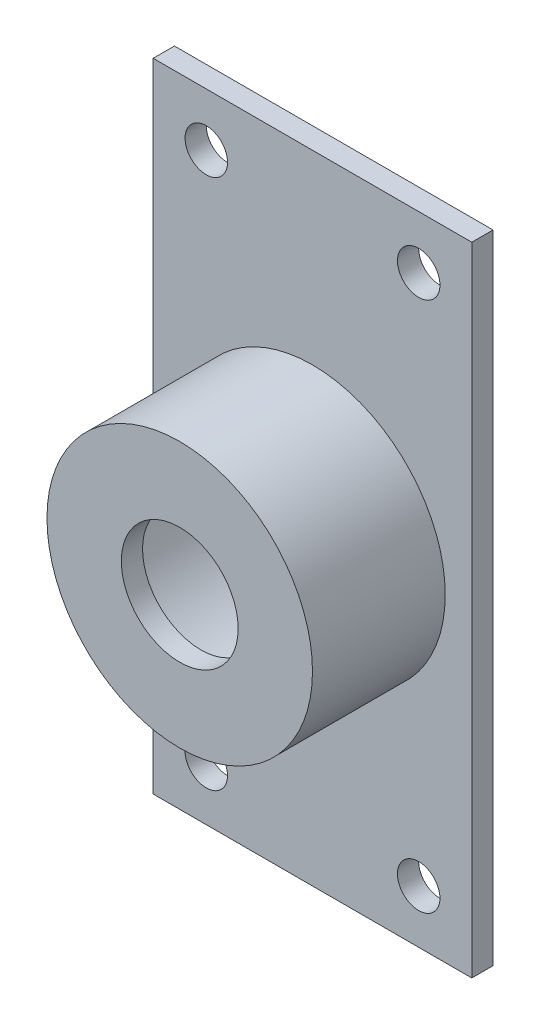
ISO-10303-21;
HEADER;
FILE_DESCRIPTION(('STEP AP214'),'2;1');
FILE_NAME('part.step','',(''),(''),'','','');
FILE_SCHEMA(('AUTOMOTIVE_DESIGN { 1 0 10303 214 1 1 1 1 }'));
ENDSEC;
DATA;
#1=APPLICATION_CONTEXT('core data for automotive mechanical design processes');
#2=APPLICATION_PROTOCOL_DEFINITION('international standard','automotive_design',2000,#1);
#3=PRODUCT_CONTEXT('',#1,'mechanical');
#4=PRODUCT('Part','Part','',(#3));
#5=PRODUCT_RELATED_PRODUCT_CATEGORY('part','',(#4));
#6=PRODUCT_DEFINITION_FORMATION('','',#4);
#7=PRODUCT_DEFINITION_CONTEXT('part definition',#1,'design');
#8=PRODUCT_DEFINITION('design','',#6,#7);
#9=PRODUCT_DEFINITION_SHAPE('','',#8);
#10=(LENGTH_UNIT() NAMED_UNIT(*) SI_UNIT(.MILLI.,.METRE.));
#11=(NAMED_UNIT(*) PLANE_ANGLE_UNIT() SI_UNIT($,.RADIAN.));
#12=(NAMED_UNIT(*) SI_UNIT($,.STERADIAN.) SOLID_ANGLE_UNIT());
#13=UNCERTAINTY_MEASURE_WITH_UNIT(LENGTH_MEASURE(1.E-05),#10,'distance_accuracy_value','');
#14=(GEOMETRIC_REPRESENTATION_CONTEXT(3) GLOBAL_UNCERTAINTY_ASSIGNED_CONTEXT((#13)) GLOBAL_UNIT_ASSIGNED_CONTEXT((#10,
#11,#12)) REPRESENTATION_CONTEXT('',''));
#15=CARTESIAN_POINT('',(0.,0.,0.));
#16=DIRECTION('',(0.,0.,1.));
#17=DIRECTION('',(1.,0.,0.));
#18=AXIS2_PLACEMENT_3D('',#15,#16,#17);
#19=CARTESIAN_POINT('',(30.,-60.,4.));
#20=DIRECTION('',(-1.,0.,0.));
#21=DIRECTION('',(0.,0.,1.));
#22=AXIS2_PLACEMENT_3D('',#19,#20,#21);
#23=PLANE('',#22);
#24=DIRECTION('',(0.,1.,0.));
#25=VECTOR('',#24,1.);
#26=CARTESIAN_POINT('',(30.,-60.,0.));
#27=LINE('',#26,#25);
#28=CARTESIAN_POINT('',(30.,-60.,0.));
#29=VERTEX_POINT('',#28);
#30=CARTESIAN_POINT('',(30.,60.,0.));
#31=VERTEX_POINT('',#30);
#32=EDGE_CURVE('E102',#29,#31,#27,.T.);
#33=ORIENTED_EDGE('',*,*,#32,.T.);
#34=DIRECTION('',(0.,0.,-1.));
#35=VECTOR('',#34,1.);
#36=CARTESIAN_POINT('',(30.,60.,4.));
#37=LINE('',#36,#35);
#38=CARTESIAN_POINT('',(30.,60.,4.));
#39=VERTEX_POINT('',#38);
#40=EDGE_CURVE('E44',#39,#31,#37,.T.);
#41=ORIENTED_EDGE('',*,*,#40,.F.);
#42=DIRECTION('',(0.,1.,0.));
#43=VECTOR('',#42,1.);
#44=CARTESIAN_POINT('',(30.,-60.,4.));
#45=LINE('',#44,#43);
#46=CARTESIAN_POINT('',(30.,-60.,4.));
#47=VERTEX_POINT('',#46);
#48=EDGE_CURVE('E88',#47,#39,#45,.T.);
#49=ORIENTED_EDGE('',*,*,#48,.F.);
#50=DIRECTION('',(0.,0.,-1.));
#51=VECTOR('',#50,1.);
#52=CARTESIAN_POINT('',(30.,-60.,4.));
#53=LINE('',#52,#51);
#54=EDGE_CURVE('E98',#47,#29,#53,.T.);
#55=ORIENTED_EDGE('',*,*,#54,.T.);
#56=EDGE_LOOP('',(#33,#41,#49,#55));
#57=FACE_BOUND('',#56,.T.);
#58=ADVANCED_FACE('F35',(#57),#23,.F.);
#59=CARTESIAN_POINT('',(-30.,60.,4.));
#60=DIRECTION('',(0.,-1.,0.));
#61=DIRECTION('',(0.,0.,-1.));
#62=AXIS2_PLACEMENT_3D('',#59,#60,#61);
#63=PLANE('',#62);
#64=DIRECTION('',(-1.,0.,0.));
#65=VECTOR('',#64,1.);
#66=CARTESIAN_POINT('',(-30.,60.,0.));
#67=LINE('',#66,#65);
#68=CARTESIAN_POINT('',(-30.,60.,0.));
#69=VERTEX_POINT('',#68);
#70=EDGE_CURVE('E93',#31,#69,#67,.T.);
#71=ORIENTED_EDGE('',*,*,#70,.T.);
#72=DIRECTION('',(0.,0.,-1.));
#73=VECTOR('',#72,1.);
#74=CARTESIAN_POINT('',(-30.,60.,4.));
#75=LINE('',#74,#73);
#76=CARTESIAN_POINT('',(-30.,60.,4.));
#77=VERTEX_POINT('',#76);
#78=EDGE_CURVE('E91',#77,#69,#75,.T.);
#79=ORIENTED_EDGE('',*,*,#78,.F.);
#80=DIRECTION('',(-1.,0.,0.));
#81=VECTOR('',#80,1.);
#82=CARTESIAN_POINT('',(-30.,60.,4.));
#83=LINE('',#82,#81);
#84=EDGE_CURVE('E83',#39,#77,#83,.T.);
#85=ORIENTED_EDGE('',*,*,#84,.F.);
#86=ORIENTED_EDGE('',*,*,#40,.T.);
#87=EDGE_LOOP('',(#71,#79,#85,#86));
#88=FACE_BOUND('',#87,.T.);
#89=ADVANCED_FACE('F92',(#88),#63,.F.);
#90=CARTESIAN_POINT('',(-30.,-60.,4.));
#91=DIRECTION('',(1.,0.,0.));
#92=DIRECTION('',(0.,0.,-1.));
#93=AXIS2_PLACEMENT_3D('',#90,#91,#92);
#94=PLANE('',#93);
#95=DIRECTION('',(0.,-1.,0.));
#96=VECTOR('',#95,1.);
#97=CARTESIAN_POINT('',(-30.,-60.,0.));
#98=LINE('',#97,#96);
#99=CARTESIAN_POINT('',(-30.,-60.,0.));
#100=VERTEX_POINT('',#99);
#101=EDGE_CURVE('E69',#69,#100,#98,.T.);
#102=ORIENTED_EDGE('',*,*,#101,.T.);
#103=DIRECTION('',(0.,0.,-1.));
#104=VECTOR('',#103,1.);
#105=CARTESIAN_POINT('',(-30.,-60.,4.));
#106=LINE('',#105,#104);
#107=CARTESIAN_POINT('',(-30.,-60.,4.));
#108=VERTEX_POINT('',#107);
#109=EDGE_CURVE('E94',#108,#100,#106,.T.);
#110=ORIENTED_EDGE('',*,*,#109,.F.);
#111=DIRECTION('',(0.,-1.,0.));
#112=VECTOR('',#111,1.);
#113=CARTESIAN_POINT('',(-30.,-60.,4.));
#114=LINE('',#113,#112);
#115=EDGE_CURVE('E86',#77,#108,#114,.T.);
#116=ORIENTED_EDGE('',*,*,#115,.F.);
#117=ORIENTED_EDGE('',*,*,#78,.T.);
#118=EDGE_LOOP('',(#102,#110,#116,#117));
#119=FACE_BOUND('',#118,.T.);
#120=ADVANCED_FACE('F96',(#119),#94,.F.);
#121=CARTESIAN_POINT('',(-30.,-60.,4.));
#122=DIRECTION('',(0.,1.,0.));
#123=DIRECTION('',(0.,0.,1.));
#124=AXIS2_PLACEMENT_3D('',#121,#122,#123);
#125=PLANE('',#124);
#126=DIRECTION('',(1.,0.,0.));
#127=VECTOR('',#126,1.);
#128=CARTESIAN_POINT('',(-30.,-60.,0.));
#129=LINE('',#128,#127);
#130=EDGE_CURVE('E75',#100,#29,#129,.T.);
#131=ORIENTED_EDGE('',*,*,#130,.T.);
#132=ORIENTED_EDGE('',*,*,#54,.F.);
#133=DIRECTION('',(1.,0.,0.));
#134=VECTOR('',#133,1.);
#135=CARTESIAN_POINT('',(-30.,-60.,4.));
#136=LINE('',#135,#134);
#137=EDGE_CURVE('E52',#108,#47,#136,.T.);
#138=ORIENTED_EDGE('',*,*,#137,.F.);
#139=ORIENTED_EDGE('',*,*,#109,.T.);
#140=EDGE_LOOP('',(#131,#132,#138,#139));
#141=FACE_BOUND('',#140,.T.);
#142=ADVANCED_FACE('F126',(#141),#125,.F.);
#143=CARTESIAN_POINT('',(0.,0.,4.));
#144=DIRECTION('',(0.,0.,-1.));
#145=DIRECTION('',(-1.,0.,0.));
#146=AXIS2_PLACEMENT_3D('',#143,#144,#145);
#147=PLANE('',#146);
#148=CARTESIAN_POINT('',(0.,0.,4.));
#149=DIRECTION('',(0.,0.,-1.));
#150=DIRECTION('',(-1.,0.,0.));
#151=AXIS2_PLACEMENT_3D('',#148,#149,#150);
#152=CIRCLE('',#151,25.);
#153=CARTESIAN_POINT('',(-25.,0.,4.));
#154=VERTEX_POINT('',#153);
#155=EDGE_CURVE('E11',#154,#154,#152,.F.);
#156=ORIENTED_EDGE('',*,*,#155,.F.);
#157=EDGE_LOOP('',(#156));
#158=FACE_BOUND('',#157,.T.);
#159=CARTESIAN_POINT('',(-19.999999999999,-50.,4.));
#160=DIRECTION('',(0.,0.,1.));
#161=DIRECTION('',(1.,0.,0.));
#162=AXIS2_PLACEMENT_3D('',#159,#160,#161);
#163=CIRCLE('',#162,4.);
#164=CARTESIAN_POINT('',(-15.999999999999,-50.,4.));
#165=VERTEX_POINT('',#164);
#166=EDGE_CURVE('E233',#165,#165,#163,.T.);
#167=ORIENTED_EDGE('',*,*,#166,.F.);
#168=EDGE_LOOP('',(#167));
#169=FACE_BOUND('',#168,.T.);
#170=CARTESIAN_POINT('',(20.000000000001,-50.,4.));
#171=DIRECTION('',(0.,0.,1.));
#172=DIRECTION('',(1.,0.,0.));
#173=AXIS2_PLACEMENT_3D('',#170,#171,#172);
#174=CIRCLE('',#173,4.);
#175=CARTESIAN_POINT('',(24.000000000001,-50.,4.));
#176=VERTEX_POINT('',#175);
#177=EDGE_CURVE('E237',#176,#176,#174,.T.);
#178=ORIENTED_EDGE('',*,*,#177,.F.);
#179=EDGE_LOOP('',(#178));
#180=FACE_BOUND('',#179,.T.);
#181=CARTESIAN_POINT('',(20.,50.,4.));
#182=DIRECTION('',(0.,0.,1.));
#183=DIRECTION('',(1.,0.,0.));
#184=AXIS2_PLACEMENT_3D('',#181,#182,#183);
#185=CIRCLE('',#184,4.);
#186=CARTESIAN_POINT('',(24.,50.,4.));
#187=VERTEX_POINT('',#186);
#188=EDGE_CURVE('E252',#187,#187,#185,.T.);
#189=ORIENTED_EDGE('',*,*,#188,.F.);
#190=EDGE_LOOP('',(#189));
#191=FACE_BOUND('',#190,.T.);
#192=CARTESIAN_POINT('',(-20.,50.,4.));
#193=DIRECTION('',(0.,0.,1.));
#194=DIRECTION('',(1.,0.,0.));
#195=AXIS2_PLACEMENT_3D('',#192,#193,#194);
#196=CIRCLE('',#195,4.);
#197=CARTESIAN_POINT('',(-16.,50.,4.));
#198=VERTEX_POINT('',#197);
#199=EDGE_CURVE('E246',#198,#198,#196,.T.);
#200=ORIENTED_EDGE('',*,*,#199,.F.);
#201=EDGE_LOOP('',(#200));
#202=FACE_BOUND('',#201,.T.);
#203=ORIENTED_EDGE('',*,*,#48,.T.);
#204=ORIENTED_EDGE('',*,*,#84,.T.);
#205=ORIENTED_EDGE('',*,*,#115,.T.);
#206=ORIENTED_EDGE('',*,*,#137,.T.);
#207=EDGE_LOOP('',(#203,#204,#205,#206));
#208=FACE_BOUND('',#207,.T.);
#209=ADVANCED_FACE('F84',(#158,#169,#180,#191,#202,#208),#147,.F.);
#210=CARTESIAN_POINT('',(0.,0.,0.));
#211=DIRECTION('',(0.,0.,-1.));
#212=DIRECTION('',(-1.,0.,0.));
#213=AXIS2_PLACEMENT_3D('',#210,#211,#212);
#214=PLANE('',#213);
#215=CARTESIAN_POINT('',(0.,0.,0.));
#216=DIRECTION('',(0.,0.,-1.));
#217=DIRECTION('',(-1.,0.,0.));
#218=AXIS2_PLACEMENT_3D('',#215,#216,#217);
#219=CIRCLE('',#218,21.6);
#220=CARTESIAN_POINT('',(-21.6,0.,0.));
#221=VERTEX_POINT('',#220);
#222=EDGE_CURVE('E274',#221,#221,#219,.T.);
#223=ORIENTED_EDGE('',*,*,#222,.F.);
#224=EDGE_LOOP('',(#223));
#225=FACE_BOUND('',#224,.T.);
#226=CARTESIAN_POINT('',(-19.999999999999,-50.,0.));
#227=DIRECTION('',(0.,0.,1.));
#228=DIRECTION('',(1.,0.,0.));
#229=AXIS2_PLACEMENT_3D('',#226,#227,#228);
#230=CIRCLE('',#229,4.);
#231=CARTESIAN_POINT('',(-15.999999999999,-50.,0.));
#232=VERTEX_POINT('',#231);
#233=EDGE_CURVE('E230',#232,#232,#230,.T.);
#234=ORIENTED_EDGE('',*,*,#233,.T.);
#235=EDGE_LOOP('',(#234));
#236=FACE_BOUND('',#235,.T.);
#237=CARTESIAN_POINT('',(20.000000000001,-50.,0.));
#238=DIRECTION('',(0.,0.,1.));
#239=DIRECTION('',(1.,0.,0.));
#240=AXIS2_PLACEMENT_3D('',#237,#238,#239);
#241=CIRCLE('',#240,4.);
#242=CARTESIAN_POINT('',(24.000000000001,-50.,0.));
#243=VERTEX_POINT('',#242);
#244=EDGE_CURVE('E257',#243,#243,#241,.T.);
#245=ORIENTED_EDGE('',*,*,#244,.T.);
#246=EDGE_LOOP('',(#245));
#247=FACE_BOUND('',#246,.T.);
#248=CARTESIAN_POINT('',(20.,50.,0.));
#249=DIRECTION('',(0.,0.,1.));
#250=DIRECTION('',(1.,0.,0.));
#251=AXIS2_PLACEMENT_3D('',#248,#249,#250);
#252=CIRCLE('',#251,4.);
#253=CARTESIAN_POINT('',(24.,50.,0.));
#254=VERTEX_POINT('',#253);
#255=EDGE_CURVE('E248',#254,#254,#252,.T.);
#256=ORIENTED_EDGE('',*,*,#255,.T.);
#257=EDGE_LOOP('',(#256));
#258=FACE_BOUND('',#257,.T.);
#259=CARTESIAN_POINT('',(-20.,50.,0.));
#260=DIRECTION('',(0.,0.,1.));
#261=DIRECTION('',(1.,0.,0.));
#262=AXIS2_PLACEMENT_3D('',#259,#260,#261);
#263=CIRCLE('',#262,4.);
#264=CARTESIAN_POINT('',(-16.,50.,0.));
#265=VERTEX_POINT('',#264);
#266=EDGE_CURVE('E105',#265,#265,#263,.T.);
#267=ORIENTED_EDGE('',*,*,#266,.T.);
#268=EDGE_LOOP('',(#267));
#269=FACE_BOUND('',#268,.T.);
#270=ORIENTED_EDGE('',*,*,#32,.F.);
#271=ORIENTED_EDGE('',*,*,#130,.F.);
#272=ORIENTED_EDGE('',*,*,#101,.F.);
#273=ORIENTED_EDGE('',*,*,#70,.F.);
#274=EDGE_LOOP('',(#270,#271,#272,#273));
#275=FACE_BOUND('',#274,.T.);
#276=ADVANCED_FACE('F114',(#225,#236,#247,#258,#269,#275),#214,.T.);
#277=CARTESIAN_POINT('',(-20.,50.,0.));
#278=DIRECTION('',(0.,0.,1.));
#279=DIRECTION('',(1.,0.,0.));
#280=AXIS2_PLACEMENT_3D('',#277,#278,#279);
#281=CYLINDRICAL_SURFACE('',#280,4.);
#282=ORIENTED_EDGE('',*,*,#266,.F.);
#283=EDGE_LOOP('',(#282));
#284=FACE_BOUND('',#283,.T.);
#285=ORIENTED_EDGE('',*,*,#199,.T.);
#286=EDGE_LOOP('',(#285));
#287=FACE_BOUND('',#286,.T.);
#288=ADVANCED_FACE('F116',(#284,#287),#281,.F.);
#289=CARTESIAN_POINT('',(20.,50.,0.));
#290=DIRECTION('',(0.,0.,1.));
#291=DIRECTION('',(1.,0.,0.));
#292=AXIS2_PLACEMENT_3D('',#289,#290,#291);
#293=CYLINDRICAL_SURFACE('',#292,4.);
#294=ORIENTED_EDGE('',*,*,#255,.F.);
#295=EDGE_LOOP('',(#294));
#296=FACE_BOUND('',#295,.T.);
#297=ORIENTED_EDGE('',*,*,#188,.T.);
#298=EDGE_LOOP('',(#297));
#299=FACE_BOUND('',#298,.T.);
#300=ADVANCED_FACE('F123',(#296,#299),#293,.F.);
#301=CARTESIAN_POINT('',(20.000000000001,-50.,0.));
#302=DIRECTION('',(0.,0.,1.));
#303=DIRECTION('',(1.,0.,0.));
#304=AXIS2_PLACEMENT_3D('',#301,#302,#303);
#305=CYLINDRICAL_SURFACE('',#304,4.);
#306=ORIENTED_EDGE('',*,*,#244,.F.);
#307=EDGE_LOOP('',(#306));
#308=FACE_BOUND('',#307,.T.);
#309=ORIENTED_EDGE('',*,*,#177,.T.);
#310=EDGE_LOOP('',(#309));
#311=FACE_BOUND('',#310,.T.);
#312=ADVANCED_FACE('F220',(#308,#311),#305,.F.);
#313=CARTESIAN_POINT('',(-19.999999999999,-50.,0.));
#314=DIRECTION('',(0.,0.,1.));
#315=DIRECTION('',(1.,0.,0.));
#316=AXIS2_PLACEMENT_3D('',#313,#314,#315);
#317=CYLINDRICAL_SURFACE('',#316,4.);
#318=ORIENTED_EDGE('',*,*,#233,.F.);
#319=EDGE_LOOP('',(#318));
#320=FACE_BOUND('',#319,.T.);
#321=ORIENTED_EDGE('',*,*,#166,.T.);
#322=EDGE_LOOP('',(#321));
#323=FACE_BOUND('',#322,.T.);
#324=ADVANCED_FACE('F157',(#320,#323),#317,.F.);
#325=CARTESIAN_POINT('',(0.,0.,29.));
#326=DIRECTION('',(0.,0.,-1.));
#327=DIRECTION('',(-1.,0.,0.));
#328=AXIS2_PLACEMENT_3D('',#325,#326,#327);
#329=CYLINDRICAL_SURFACE('',#328,25.);
#330=CARTESIAN_POINT('',(0.,0.,29.));
#331=DIRECTION('',(0.,0.,1.));
#332=DIRECTION('',(1.,0.,0.));
#333=AXIS2_PLACEMENT_3D('',#330,#331,#332);
#334=CIRCLE('',#333,25.);
#335=CARTESIAN_POINT('',(25.,0.,29.));
#336=VERTEX_POINT('',#335);
#337=EDGE_CURVE('E235',#336,#336,#334,.T.);
#338=ORIENTED_EDGE('',*,*,#337,.F.);
#339=EDGE_LOOP('',(#338));
#340=FACE_BOUND('',#339,.T.);
#341=ORIENTED_EDGE('',*,*,#155,.T.);
#342=EDGE_LOOP('',(#341));
#343=FACE_BOUND('',#342,.T.);
#344=ADVANCED_FACE('F162',(#340,#343),#329,.T.);
#345=CARTESIAN_POINT('',(0.,0.,29.));
#346=DIRECTION('',(0.,0.,1.));
#347=DIRECTION('',(1.,0.,0.));
#348=AXIS2_PLACEMENT_3D('',#345,#346,#347);
#349=PLANE('',#348);
#350=CARTESIAN_POINT('',(0.,0.,29.));
#351=DIRECTION('',(0.,0.,1.));
#352=DIRECTION('',(1.,0.,0.));
#353=AXIS2_PLACEMENT_3D('',#350,#351,#352);
#354=CIRCLE('',#353,11.);
#355=CARTESIAN_POINT('',(11.,0.,29.));
#356=VERTEX_POINT('',#355);
#357=EDGE_CURVE('E279',#356,#356,#354,.T.);
#358=ORIENTED_EDGE('',*,*,#357,.F.);
#359=EDGE_LOOP('',(#358));
#360=FACE_BOUND('',#359,.T.);
#361=ORIENTED_EDGE('',*,*,#337,.T.);
#362=EDGE_LOOP('',(#361));
#363=FACE_BOUND('',#362,.T.);
#364=ADVANCED_FACE('F166',(#360,#363),#349,.T.);
#365=CARTESIAN_POINT('',(0.,0.,25.));
#366=DIRECTION('',(0.,0.,-1.));
#367=DIRECTION('',(-1.,0.,0.));
#368=AXIS2_PLACEMENT_3D('',#365,#366,#367);
#369=CYLINDRICAL_SURFACE('',#368,21.6);
#370=CARTESIAN_POINT('',(0.,0.,25.));
#371=DIRECTION('',(0.,0.,-1.));
#372=DIRECTION('',(-1.,0.,0.));
#373=AXIS2_PLACEMENT_3D('',#370,#371,#372);
#374=CIRCLE('',#373,21.6);
#375=CARTESIAN_POINT('',(-21.6,0.,25.));
#376=VERTEX_POINT('',#375);
#377=EDGE_CURVE('E240',#376,#376,#374,.T.);
#378=ORIENTED_EDGE('',*,*,#377,.F.);
#379=EDGE_LOOP('',(#378));
#380=FACE_BOUND('',#379,.T.);
#381=ORIENTED_EDGE('',*,*,#222,.T.);
#382=EDGE_LOOP('',(#381));
#383=FACE_BOUND('',#382,.T.);
#384=ADVANCED_FACE('F179',(#380,#383),#369,.F.);
#385=CARTESIAN_POINT('',(0.,0.,25.));
#386=DIRECTION('',(0.,0.,-1.));
#387=DIRECTION('',(-1.,0.,0.));
#388=AXIS2_PLACEMENT_3D('',#385,#386,#387);
#389=PLANE('',#388);
#390=CARTESIAN_POINT('',(0.,0.,25.));
#391=DIRECTION('',(0.,0.,-1.));
#392=DIRECTION('',(-1.,0.,0.));
#393=AXIS2_PLACEMENT_3D('',#390,#391,#392);
#394=CIRCLE('',#393,11.);
#395=CARTESIAN_POINT('',(-11.,0.,25.));
#396=VERTEX_POINT('',#395);
#397=EDGE_CURVE('E38',#396,#396,#394,.T.);
#398=ORIENTED_EDGE('',*,*,#397,.F.);
#399=EDGE_LOOP('',(#398));
#400=FACE_BOUND('',#399,.T.);
#401=ORIENTED_EDGE('',*,*,#377,.T.);
#402=EDGE_LOOP('',(#401));
#403=FACE_BOUND('',#402,.T.);
#404=ADVANCED_FACE('F184',(#400,#403),#389,.T.);
#405=CARTESIAN_POINT('',(0.,0.,4.));
#406=DIRECTION('',(0.,0.,1.));
#407=DIRECTION('',(1.,0.,0.));
#408=AXIS2_PLACEMENT_3D('',#405,#406,#407);
#409=CYLINDRICAL_SURFACE('',#408,11.);
#410=ORIENTED_EDGE('',*,*,#397,.T.);
#411=EDGE_LOOP('',(#410));
#412=FACE_BOUND('',#411,.T.);
#413=ORIENTED_EDGE('',*,*,#357,.T.);
#414=EDGE_LOOP('',(#413));
#415=FACE_BOUND('',#414,.T.);
#416=ADVANCED_FACE('F201',(#412,#415),#409,.F.);
#417=CLOSED_SHELL('',(#58,#89,#120,#142,#209,#276,#288,#300,#312,#324,#344,#364,#384,#404,#416));
#418=MANIFOLD_SOLID_BREP('B2',#417);
#419=ADVANCED_BREP_SHAPE_REPRESENTATION('',(#18,#418),#14);
#420=SHAPE_DEFINITION_REPRESENTATION(#9,#419);
ENDSEC;
END-ISO-10303-21;
